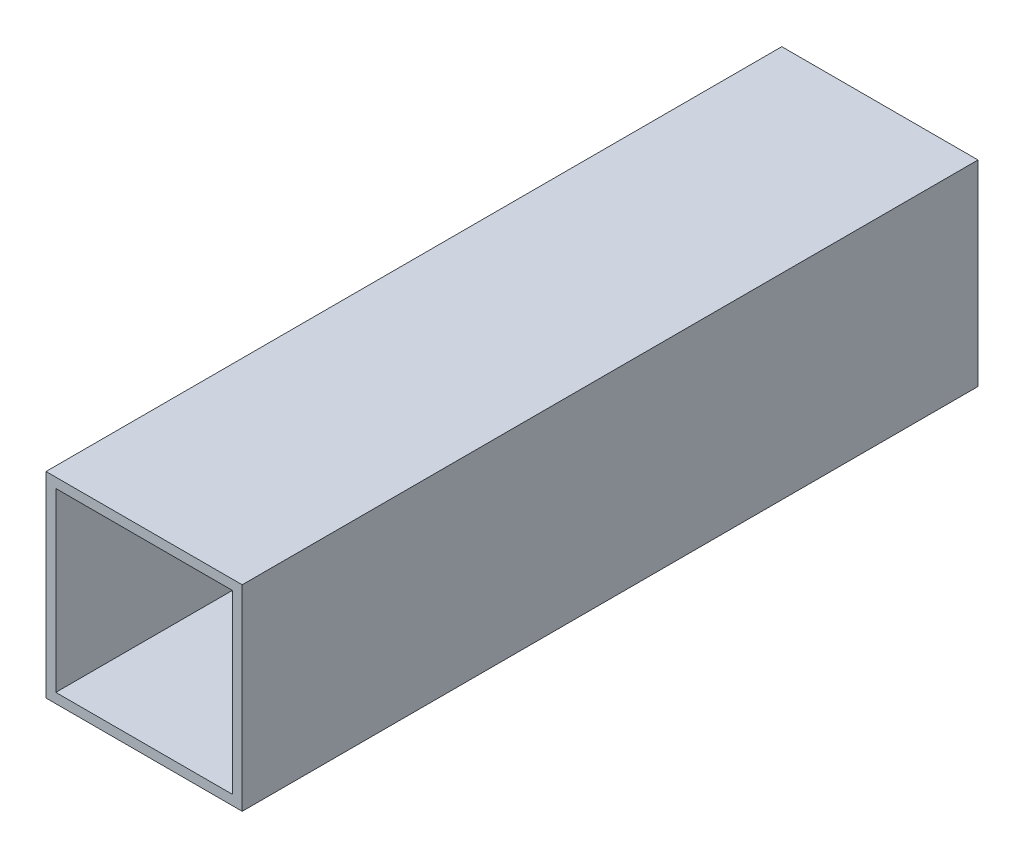
ISO-10303-21;
HEADER;
FILE_DESCRIPTION(('STEP AP214'),'2;1');
FILE_NAME('part.step','',(''),(''),'','','');
FILE_SCHEMA(('AUTOMOTIVE_DESIGN { 1 0 10303 214 1 1 1 1 }'));
ENDSEC;
DATA;
#1=APPLICATION_CONTEXT('core data for automotive mechanical design processes');
#2=APPLICATION_PROTOCOL_DEFINITION('international standard','automotive_design',2000,#1);
#3=PRODUCT_CONTEXT('',#1,'mechanical');
#4=PRODUCT('Part','Part','',(#3));
#5=PRODUCT_RELATED_PRODUCT_CATEGORY('part','',(#4));
#6=PRODUCT_DEFINITION_FORMATION('','',#4);
#7=PRODUCT_DEFINITION_CONTEXT('part definition',#1,'design');
#8=PRODUCT_DEFINITION('design','',#6,#7);
#9=PRODUCT_DEFINITION_SHAPE('','',#8);
#10=(LENGTH_UNIT() NAMED_UNIT(*) SI_UNIT(.MILLI.,.METRE.));
#11=(NAMED_UNIT(*) PLANE_ANGLE_UNIT() SI_UNIT($,.RADIAN.));
#12=(NAMED_UNIT(*) SI_UNIT($,.STERADIAN.) SOLID_ANGLE_UNIT());
#13=UNCERTAINTY_MEASURE_WITH_UNIT(LENGTH_MEASURE(1.E-05),#10,'distance_accuracy_value','');
#14=(GEOMETRIC_REPRESENTATION_CONTEXT(3) GLOBAL_UNCERTAINTY_ASSIGNED_CONTEXT((#13)) GLOBAL_UNIT_ASSIGNED_CONTEXT((#10,
#11,#12)) REPRESENTATION_CONTEXT('',''));
#15=CARTESIAN_POINT('',(0.,0.,0.));
#16=DIRECTION('',(0.,0.,1.));
#17=DIRECTION('',(1.,0.,0.));
#18=AXIS2_PLACEMENT_3D('',#15,#16,#17);
#19=CARTESIAN_POINT('',(0.,0.,187.5));
#20=DIRECTION('',(0.,0.,-1.));
#21=DIRECTION('',(-1.,0.,0.));
#22=AXIS2_PLACEMENT_3D('',#19,#20,#21);
#23=PLANE('',#22);
#24=DIRECTION('',(0.,-1.,0.));
#25=VECTOR('',#24,1.);
#26=CARTESIAN_POINT('',(-50.,-50.,187.5));
#27=LINE('',#26,#25);
#28=CARTESIAN_POINT('',(-50.,49.9999999999999,187.5));
#29=VERTEX_POINT('',#28);
#30=CARTESIAN_POINT('',(-50.,-50.,187.5));
#31=VERTEX_POINT('',#30);
#32=EDGE_CURVE('E137',#29,#31,#27,.T.);
#33=ORIENTED_EDGE('',*,*,#32,.T.);
#34=DIRECTION('',(1.,0.,0.));
#35=VECTOR('',#34,1.);
#36=CARTESIAN_POINT('',(-50.,-50.,187.5));
#37=LINE('',#36,#35);
#38=CARTESIAN_POINT('',(50.,-50.,187.5));
#39=VERTEX_POINT('',#38);
#40=EDGE_CURVE('E141',#31,#39,#37,.T.);
#41=ORIENTED_EDGE('',*,*,#40,.T.);
#42=DIRECTION('',(0.,1.,0.));
#43=VECTOR('',#42,1.);
#44=CARTESIAN_POINT('',(50.,-50.,187.5));
#45=LINE('',#44,#43);
#46=CARTESIAN_POINT('',(49.9999999999999,49.9999999999999,187.5));
#47=VERTEX_POINT('',#46);
#48=EDGE_CURVE('E148',#39,#47,#45,.T.);
#49=ORIENTED_EDGE('',*,*,#48,.T.);
#50=DIRECTION('',(-1.,0.,0.));
#51=VECTOR('',#50,1.);
#52=CARTESIAN_POINT('',(-50.,49.9999999999999,187.5));
#53=LINE('',#52,#51);
#54=EDGE_CURVE('E146',#47,#29,#53,.T.);
#55=ORIENTED_EDGE('',*,*,#54,.T.);
#56=EDGE_LOOP('',(#33,#41,#49,#55));
#57=FACE_BOUND('',#56,.T.);
#58=DIRECTION('',(0.,-1.,0.));
#59=VECTOR('',#58,1.);
#60=CARTESIAN_POINT('',(-45.,-45.,187.5));
#61=LINE('',#60,#59);
#62=CARTESIAN_POINT('',(-45.,44.9999999999999,187.5));
#63=VERTEX_POINT('',#62);
#64=CARTESIAN_POINT('',(-45.,-45.,187.5));
#65=VERTEX_POINT('',#64);
#66=EDGE_CURVE('E102',#63,#65,#61,.T.);
#67=ORIENTED_EDGE('',*,*,#66,.F.);
#68=DIRECTION('',(-1.,0.,0.));
#69=VECTOR('',#68,1.);
#70=CARTESIAN_POINT('',(-45.,44.9999999999999,187.5));
#71=LINE('',#70,#69);
#72=CARTESIAN_POINT('',(45.,44.9999999999999,187.5));
#73=VERTEX_POINT('',#72);
#74=EDGE_CURVE('E127',#73,#63,#71,.T.);
#75=ORIENTED_EDGE('',*,*,#74,.F.);
#76=DIRECTION('',(0.,1.,0.));
#77=VECTOR('',#76,1.);
#78=CARTESIAN_POINT('',(45.,-45.,187.5));
#79=LINE('',#78,#77);
#80=CARTESIAN_POINT('',(45.,-45.,187.5));
#81=VERTEX_POINT('',#80);
#82=EDGE_CURVE('E123',#81,#73,#79,.T.);
#83=ORIENTED_EDGE('',*,*,#82,.F.);
#84=DIRECTION('',(1.,0.,0.));
#85=VECTOR('',#84,1.);
#86=CARTESIAN_POINT('',(-45.,-45.,187.5));
#87=LINE('',#86,#85);
#88=EDGE_CURVE('E115',#65,#81,#87,.T.);
#89=ORIENTED_EDGE('',*,*,#88,.F.);
#90=EDGE_LOOP('',(#67,#75,#83,#89));
#91=FACE_BOUND('',#90,.T.);
#92=ADVANCED_FACE('F39',(#57,#91),#23,.F.);
#93=CARTESIAN_POINT('',(0.,0.,-187.5));
#94=DIRECTION('',(0.,0.,-1.));
#95=DIRECTION('',(-1.,0.,0.));
#96=AXIS2_PLACEMENT_3D('',#93,#94,#95);
#97=PLANE('',#96);
#98=DIRECTION('',(0.,-1.,0.));
#99=VECTOR('',#98,1.);
#100=CARTESIAN_POINT('',(-50.,-50.,-187.5));
#101=LINE('',#100,#99);
#102=CARTESIAN_POINT('',(-50.,49.9999999999999,-187.5));
#103=VERTEX_POINT('',#102);
#104=CARTESIAN_POINT('',(-50.,-50.,-187.5));
#105=VERTEX_POINT('',#104);
#106=EDGE_CURVE('E117',#103,#105,#101,.T.);
#107=ORIENTED_EDGE('',*,*,#106,.F.);
#108=DIRECTION('',(-1.,0.,0.));
#109=VECTOR('',#108,1.);
#110=CARTESIAN_POINT('',(-50.,49.9999999999999,-187.5));
#111=LINE('',#110,#109);
#112=CARTESIAN_POINT('',(49.9999999999999,49.9999999999999,-187.5));
#113=VERTEX_POINT('',#112);
#114=EDGE_CURVE('E145',#113,#103,#111,.T.);
#115=ORIENTED_EDGE('',*,*,#114,.F.);
#116=DIRECTION('',(0.,1.,0.));
#117=VECTOR('',#116,1.);
#118=CARTESIAN_POINT('',(50.,-50.,-187.5));
#119=LINE('',#118,#117);
#120=CARTESIAN_POINT('',(50.,-50.,-187.5));
#121=VERTEX_POINT('',#120);
#122=EDGE_CURVE('E154',#121,#113,#119,.T.);
#123=ORIENTED_EDGE('',*,*,#122,.F.);
#124=DIRECTION('',(1.,0.,0.));
#125=VECTOR('',#124,1.);
#126=CARTESIAN_POINT('',(-50.,-50.,-187.5));
#127=LINE('',#126,#125);
#128=EDGE_CURVE('E153',#105,#121,#127,.T.);
#129=ORIENTED_EDGE('',*,*,#128,.F.);
#130=EDGE_LOOP('',(#107,#115,#123,#129));
#131=FACE_BOUND('',#130,.T.);
#132=DIRECTION('',(-1.,0.,0.));
#133=VECTOR('',#132,1.);
#134=CARTESIAN_POINT('',(-45.,44.9999999999999,-187.5));
#135=LINE('',#134,#133);
#136=CARTESIAN_POINT('',(45.,44.9999999999999,-187.5));
#137=VERTEX_POINT('',#136);
#138=CARTESIAN_POINT('',(-45.,44.9999999999999,-187.5));
#139=VERTEX_POINT('',#138);
#140=EDGE_CURVE('E114',#137,#139,#135,.T.);
#141=ORIENTED_EDGE('',*,*,#140,.T.);
#142=DIRECTION('',(0.,-1.,0.));
#143=VECTOR('',#142,1.);
#144=CARTESIAN_POINT('',(-45.,-45.,-187.5));
#145=LINE('',#144,#143);
#146=CARTESIAN_POINT('',(-45.,-45.,-187.5));
#147=VERTEX_POINT('',#146);
#148=EDGE_CURVE('E61',#139,#147,#145,.T.);
#149=ORIENTED_EDGE('',*,*,#148,.T.);
#150=DIRECTION('',(1.,0.,0.));
#151=VECTOR('',#150,1.);
#152=CARTESIAN_POINT('',(-45.,-45.,-187.5));
#153=LINE('',#152,#151);
#154=CARTESIAN_POINT('',(45.,-45.,-187.5));
#155=VERTEX_POINT('',#154);
#156=EDGE_CURVE('E118',#147,#155,#153,.T.);
#157=ORIENTED_EDGE('',*,*,#156,.T.);
#158=DIRECTION('',(0.,1.,0.));
#159=VECTOR('',#158,1.);
#160=CARTESIAN_POINT('',(45.,-45.,-187.5));
#161=LINE('',#160,#159);
#162=EDGE_CURVE('E131',#155,#137,#161,.T.);
#163=ORIENTED_EDGE('',*,*,#162,.T.);
#164=EDGE_LOOP('',(#141,#149,#157,#163));
#165=FACE_BOUND('',#164,.T.);
#166=ADVANCED_FACE('F175',(#131,#165),#97,.T.);
#167=CARTESIAN_POINT('',(-50.,-50.,187.5));
#168=DIRECTION('',(1.,0.,0.));
#169=DIRECTION('',(0.,0.,-1.));
#170=AXIS2_PLACEMENT_3D('',#167,#168,#169);
#171=PLANE('',#170);
#172=ORIENTED_EDGE('',*,*,#106,.T.);
#173=DIRECTION('',(0.,0.,-1.));
#174=VECTOR('',#173,1.);
#175=CARTESIAN_POINT('',(-50.,-50.,187.5));
#176=LINE('',#175,#174);
#177=EDGE_CURVE('E11',#31,#105,#176,.T.);
#178=ORIENTED_EDGE('',*,*,#177,.F.);
#179=ORIENTED_EDGE('',*,*,#32,.F.);
#180=DIRECTION('',(0.,0.,-1.));
#181=VECTOR('',#180,1.);
#182=CARTESIAN_POINT('',(-50.,49.9999999999999,187.5));
#183=LINE('',#182,#181);
#184=EDGE_CURVE('E147',#29,#103,#183,.T.);
#185=ORIENTED_EDGE('',*,*,#184,.T.);
#186=EDGE_LOOP('',(#172,#178,#179,#185));
#187=FACE_BOUND('',#186,.T.);
#188=ADVANCED_FACE('F41',(#187),#171,.F.);
#189=CARTESIAN_POINT('',(-50.,-50.,187.5));
#190=DIRECTION('',(0.,1.,0.));
#191=DIRECTION('',(0.,0.,1.));
#192=AXIS2_PLACEMENT_3D('',#189,#190,#191);
#193=PLANE('',#192);
#194=ORIENTED_EDGE('',*,*,#128,.T.);
#195=DIRECTION('',(0.,0.,-1.));
#196=VECTOR('',#195,1.);
#197=CARTESIAN_POINT('',(50.,-50.,187.5));
#198=LINE('',#197,#196);
#199=EDGE_CURVE('E50',#39,#121,#198,.T.);
#200=ORIENTED_EDGE('',*,*,#199,.F.);
#201=ORIENTED_EDGE('',*,*,#40,.F.);
#202=ORIENTED_EDGE('',*,*,#177,.T.);
#203=EDGE_LOOP('',(#194,#200,#201,#202));
#204=FACE_BOUND('',#203,.T.);
#205=ADVANCED_FACE('F181',(#204),#193,.F.);
#206=CARTESIAN_POINT('',(50.,-50.,187.5));
#207=DIRECTION('',(-1.,0.,0.));
#208=DIRECTION('',(0.,-1.,0.));
#209=AXIS2_PLACEMENT_3D('',#206,#207,#208);
#210=PLANE('',#209);
#211=ORIENTED_EDGE('',*,*,#122,.T.);
#212=DIRECTION('',(0.,0.,-1.));
#213=VECTOR('',#212,1.);
#214=CARTESIAN_POINT('',(49.9999999999999,49.9999999999999,187.5));
#215=LINE('',#214,#213);
#216=EDGE_CURVE('E159',#47,#113,#215,.T.);
#217=ORIENTED_EDGE('',*,*,#216,.F.);
#218=ORIENTED_EDGE('',*,*,#48,.F.);
#219=ORIENTED_EDGE('',*,*,#199,.T.);
#220=EDGE_LOOP('',(#211,#217,#218,#219));
#221=FACE_BOUND('',#220,.T.);
#222=ADVANCED_FACE('F170',(#221),#210,.F.);
#223=CARTESIAN_POINT('',(-50.,49.9999999999999,187.5));
#224=DIRECTION('',(0.,-1.,0.));
#225=DIRECTION('',(0.,0.,-1.));
#226=AXIS2_PLACEMENT_3D('',#223,#224,#225);
#227=PLANE('',#226);
#228=ORIENTED_EDGE('',*,*,#114,.T.);
#229=ORIENTED_EDGE('',*,*,#184,.F.);
#230=ORIENTED_EDGE('',*,*,#54,.F.);
#231=ORIENTED_EDGE('',*,*,#216,.T.);
#232=EDGE_LOOP('',(#228,#229,#230,#231));
#233=FACE_BOUND('',#232,.T.);
#234=ADVANCED_FACE('F180',(#233),#227,.F.);
#235=CARTESIAN_POINT('',(-45.,-45.,187.5));
#236=DIRECTION('',(1.,0.,0.));
#237=DIRECTION('',(0.,0.,-1.));
#238=AXIS2_PLACEMENT_3D('',#235,#236,#237);
#239=PLANE('',#238);
#240=ORIENTED_EDGE('',*,*,#148,.F.);
#241=DIRECTION('',(0.,0.,-1.));
#242=VECTOR('',#241,1.);
#243=CARTESIAN_POINT('',(-45.,44.9999999999999,187.5));
#244=LINE('',#243,#242);
#245=EDGE_CURVE('E107',#63,#139,#244,.T.);
#246=ORIENTED_EDGE('',*,*,#245,.F.);
#247=ORIENTED_EDGE('',*,*,#66,.T.);
#248=DIRECTION('',(0.,0.,-1.));
#249=VECTOR('',#248,1.);
#250=CARTESIAN_POINT('',(-45.,-45.,187.5));
#251=LINE('',#250,#249);
#252=EDGE_CURVE('E110',#65,#147,#251,.T.);
#253=ORIENTED_EDGE('',*,*,#252,.T.);
#254=EDGE_LOOP('',(#240,#246,#247,#253));
#255=FACE_BOUND('',#254,.T.);
#256=ADVANCED_FACE('F106',(#255),#239,.T.);
#257=CARTESIAN_POINT('',(-45.,-45.,187.5));
#258=DIRECTION('',(0.,1.,0.));
#259=DIRECTION('',(0.,0.,1.));
#260=AXIS2_PLACEMENT_3D('',#257,#258,#259);
#261=PLANE('',#260);
#262=ORIENTED_EDGE('',*,*,#156,.F.);
#263=ORIENTED_EDGE('',*,*,#252,.F.);
#264=ORIENTED_EDGE('',*,*,#88,.T.);
#265=DIRECTION('',(0.,0.,-1.));
#266=VECTOR('',#265,1.);
#267=CARTESIAN_POINT('',(45.,-45.,187.5));
#268=LINE('',#267,#266);
#269=EDGE_CURVE('E121',#81,#155,#268,.T.);
#270=ORIENTED_EDGE('',*,*,#269,.T.);
#271=EDGE_LOOP('',(#262,#263,#264,#270));
#272=FACE_BOUND('',#271,.T.);
#273=ADVANCED_FACE('F119',(#272),#261,.T.);
#274=CARTESIAN_POINT('',(45.,-45.,187.5));
#275=DIRECTION('',(-1.,0.,0.));
#276=DIRECTION('',(0.,-1.,0.));
#277=AXIS2_PLACEMENT_3D('',#274,#275,#276);
#278=PLANE('',#277);
#279=ORIENTED_EDGE('',*,*,#162,.F.);
#280=ORIENTED_EDGE('',*,*,#269,.F.);
#281=ORIENTED_EDGE('',*,*,#82,.T.);
#282=DIRECTION('',(0.,0.,-1.));
#283=VECTOR('',#282,1.);
#284=CARTESIAN_POINT('',(45.,44.9999999999999,187.5));
#285=LINE('',#284,#283);
#286=EDGE_CURVE('E53',#73,#137,#285,.T.);
#287=ORIENTED_EDGE('',*,*,#286,.T.);
#288=EDGE_LOOP('',(#279,#280,#281,#287));
#289=FACE_BOUND('',#288,.T.);
#290=ADVANCED_FACE('F206',(#289),#278,.T.);
#291=CARTESIAN_POINT('',(-45.,44.9999999999999,187.5));
#292=DIRECTION('',(0.,-1.,0.));
#293=DIRECTION('',(0.,0.,-1.));
#294=AXIS2_PLACEMENT_3D('',#291,#292,#293);
#295=PLANE('',#294);
#296=ORIENTED_EDGE('',*,*,#140,.F.);
#297=ORIENTED_EDGE('',*,*,#286,.F.);
#298=ORIENTED_EDGE('',*,*,#74,.T.);
#299=ORIENTED_EDGE('',*,*,#245,.T.);
#300=EDGE_LOOP('',(#296,#297,#298,#299));
#301=FACE_BOUND('',#300,.T.);
#302=ADVANCED_FACE('F209',(#301),#295,.T.);
#303=CLOSED_SHELL('',(#92,#166,#188,#205,#222,#234,#256,#273,#290,#302));
#304=MANIFOLD_SOLID_BREP('B2',#303);
#305=ADVANCED_BREP_SHAPE_REPRESENTATION('',(#18,#304),#14);
#306=SHAPE_DEFINITION_REPRESENTATION(#9,#305);
ENDSEC;
END-ISO-10303-21;
